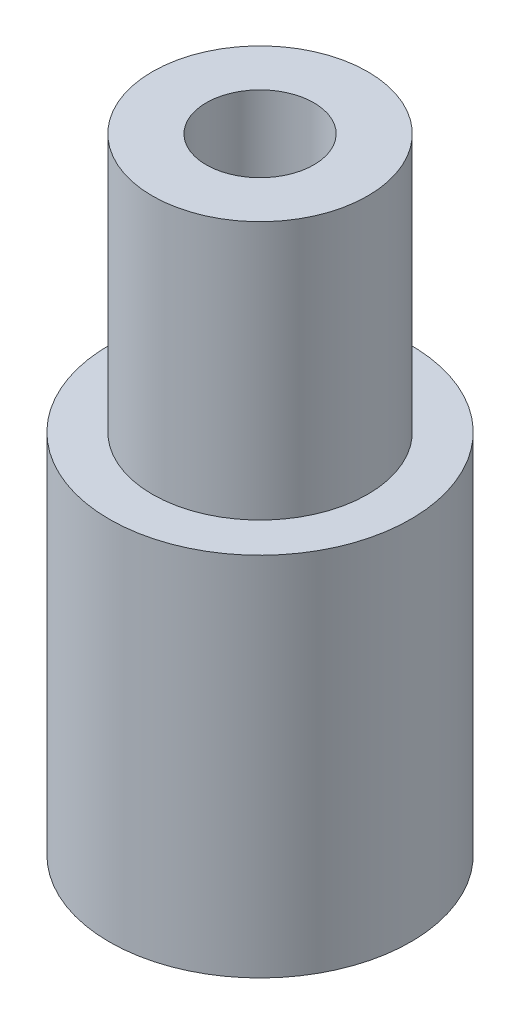
ISO-10303-21;
HEADER;
FILE_DESCRIPTION(('STEP AP214'),'2;1');
FILE_NAME('part.step','',(''),(''),'','','');
FILE_SCHEMA(('AUTOMOTIVE_DESIGN { 1 0 10303 214 1 1 1 1 }'));
ENDSEC;
DATA;
#1=APPLICATION_CONTEXT('core data for automotive mechanical design processes');
#2=APPLICATION_PROTOCOL_DEFINITION('international standard','automotive_design',2000,#1);
#3=PRODUCT_CONTEXT('',#1,'mechanical');
#4=PRODUCT('Part','Part','',(#3));
#5=PRODUCT_RELATED_PRODUCT_CATEGORY('part','',(#4));
#6=PRODUCT_DEFINITION_FORMATION('','',#4);
#7=PRODUCT_DEFINITION_CONTEXT('part definition',#1,'design');
#8=PRODUCT_DEFINITION('design','',#6,#7);
#9=PRODUCT_DEFINITION_SHAPE('','',#8);
#10=(LENGTH_UNIT() NAMED_UNIT(*) SI_UNIT(.MILLI.,.METRE.));
#11=(NAMED_UNIT(*) PLANE_ANGLE_UNIT() SI_UNIT($,.RADIAN.));
#12=(NAMED_UNIT(*) SI_UNIT($,.STERADIAN.) SOLID_ANGLE_UNIT());
#13=UNCERTAINTY_MEASURE_WITH_UNIT(LENGTH_MEASURE(1.E-05),#10,'distance_accuracy_value','');
#14=(GEOMETRIC_REPRESENTATION_CONTEXT(3) GLOBAL_UNCERTAINTY_ASSIGNED_CONTEXT((#13)) GLOBAL_UNIT_ASSIGNED_CONTEXT((#10,
#11,#12)) REPRESENTATION_CONTEXT('',''));
#15=CARTESIAN_POINT('',(0.,0.,0.));
#16=DIRECTION('',(0.,0.,1.));
#17=DIRECTION('',(1.,0.,0.));
#18=AXIS2_PLACEMENT_3D('',#15,#16,#17);
#19=CARTESIAN_POINT('',(0.,17.,0.));
#20=DIRECTION('',(0.,-1.,0.));
#21=DIRECTION('',(0.,0.,-1.));
#22=AXIS2_PLACEMENT_3D('',#19,#20,#21);
#23=CYLINDRICAL_SURFACE('',#22,7.);
#24=CARTESIAN_POINT('',(0.,17.,0.));
#25=DIRECTION('',(0.,1.,0.));
#26=DIRECTION('',(0.,0.,1.));
#27=AXIS2_PLACEMENT_3D('',#24,#25,#26);
#28=CIRCLE('',#27,7.);
#29=CARTESIAN_POINT('',(0.,17.,7.));
#30=VERTEX_POINT('',#29);
#31=EDGE_CURVE('E40',#30,#30,#28,.T.);
#32=ORIENTED_EDGE('',*,*,#31,.F.);
#33=EDGE_LOOP('',(#32));
#34=FACE_BOUND('',#33,.T.);
#35=CARTESIAN_POINT('',(0.,0.,0.));
#36=DIRECTION('',(0.,1.,0.));
#37=DIRECTION('',(0.,0.,1.));
#38=AXIS2_PLACEMENT_3D('',#35,#36,#37);
#39=CIRCLE('',#38,7.);
#40=CARTESIAN_POINT('',(0.,0.,7.));
#41=VERTEX_POINT('',#40);
#42=EDGE_CURVE('E36',#41,#41,#39,.T.);
#43=ORIENTED_EDGE('',*,*,#42,.T.);
#44=EDGE_LOOP('',(#43));
#45=FACE_BOUND('',#44,.T.);
#46=ADVANCED_FACE('F33',(#34,#45),#23,.T.);
#47=CARTESIAN_POINT('',(0.,17.,0.));
#48=DIRECTION('',(0.,1.,0.));
#49=DIRECTION('',(0.,0.,1.));
#50=AXIS2_PLACEMENT_3D('',#47,#48,#49);
#51=PLANE('',#50);
#52=CARTESIAN_POINT('',(0.,17.,0.));
#53=DIRECTION('',(0.,1.,0.));
#54=DIRECTION('',(0.,0.,1.));
#55=AXIS2_PLACEMENT_3D('',#52,#53,#54);
#56=CIRCLE('',#55,5.);
#57=CARTESIAN_POINT('',(0.,17.,5.));
#58=VERTEX_POINT('',#57);
#59=EDGE_CURVE('E10',#58,#58,#56,.T.);
#60=ORIENTED_EDGE('',*,*,#59,.F.);
#61=EDGE_LOOP('',(#60));
#62=FACE_BOUND('',#61,.T.);
#63=ORIENTED_EDGE('',*,*,#31,.T.);
#64=EDGE_LOOP('',(#63));
#65=FACE_BOUND('',#64,.T.);
#66=ADVANCED_FACE('F77',(#62,#65),#51,.T.);
#67=CARTESIAN_POINT('',(0.,0.,0.));
#68=DIRECTION('',(0.,1.,0.));
#69=DIRECTION('',(0.,0.,1.));
#70=AXIS2_PLACEMENT_3D('',#67,#68,#69);
#71=PLANE('',#70);
#72=ORIENTED_EDGE('',*,*,#42,.F.);
#73=EDGE_LOOP('',(#72));
#74=FACE_BOUND('',#73,.T.);
#75=ADVANCED_FACE('F72',(#74),#71,.F.);
#76=CARTESIAN_POINT('',(0.,29.,0.));
#77=DIRECTION('',(0.,-1.,0.));
#78=DIRECTION('',(0.,0.,-1.));
#79=AXIS2_PLACEMENT_3D('',#76,#77,#78);
#80=CYLINDRICAL_SURFACE('',#79,5.);
#81=CARTESIAN_POINT('',(0.,29.,0.));
#82=DIRECTION('',(0.,1.,0.));
#83=DIRECTION('',(0.,0.,1.));
#84=AXIS2_PLACEMENT_3D('',#81,#82,#83);
#85=CIRCLE('',#84,5.);
#86=CARTESIAN_POINT('',(0.,29.,5.));
#87=VERTEX_POINT('',#86);
#88=EDGE_CURVE('E46',#87,#87,#85,.T.);
#89=ORIENTED_EDGE('',*,*,#88,.F.);
#90=EDGE_LOOP('',(#89));
#91=FACE_BOUND('',#90,.T.);
#92=ORIENTED_EDGE('',*,*,#59,.T.);
#93=EDGE_LOOP('',(#92));
#94=FACE_BOUND('',#93,.T.);
#95=ADVANCED_FACE('F67',(#91,#94),#80,.T.);
#96=CARTESIAN_POINT('',(0.,29.,0.));
#97=DIRECTION('',(0.,1.,0.));
#98=DIRECTION('',(0.,0.,1.));
#99=AXIS2_PLACEMENT_3D('',#96,#97,#98);
#100=PLANE('',#99);
#101=CARTESIAN_POINT('',(0.,29.,0.));
#102=DIRECTION('',(0.,1.,0.));
#103=DIRECTION('',(0.,0.,1.));
#104=AXIS2_PLACEMENT_3D('',#101,#102,#103);
#105=CIRCLE('',#104,2.5);
#106=CARTESIAN_POINT('',(0.,29.,2.5));
#107=VERTEX_POINT('',#106);
#108=EDGE_CURVE('E50',#107,#107,#105,.T.);
#109=ORIENTED_EDGE('',*,*,#108,.F.);
#110=EDGE_LOOP('',(#109));
#111=FACE_BOUND('',#110,.T.);
#112=ORIENTED_EDGE('',*,*,#88,.T.);
#113=EDGE_LOOP('',(#112));
#114=FACE_BOUND('',#113,.T.);
#115=ADVANCED_FACE('F61',(#111,#114),#100,.T.);
#116=CARTESIAN_POINT('',(0.,15.,0.));
#117=DIRECTION('',(0.,1.,0.));
#118=DIRECTION('',(0.,0.,1.));
#119=AXIS2_PLACEMENT_3D('',#116,#117,#118);
#120=CYLINDRICAL_SURFACE('',#119,2.5);
#121=CARTESIAN_POINT('',(0.,15.,0.));
#122=DIRECTION('',(0.,1.,0.));
#123=DIRECTION('',(0.,0.,1.));
#124=AXIS2_PLACEMENT_3D('',#121,#122,#123);
#125=CIRCLE('',#124,2.5);
#126=CARTESIAN_POINT('',(0.,15.,2.5));
#127=VERTEX_POINT('',#126);
#128=EDGE_CURVE('E49',#127,#127,#125,.T.);
#129=ORIENTED_EDGE('',*,*,#128,.F.);
#130=EDGE_LOOP('',(#129));
#131=FACE_BOUND('',#130,.T.);
#132=ORIENTED_EDGE('',*,*,#108,.T.);
#133=EDGE_LOOP('',(#132));
#134=FACE_BOUND('',#133,.T.);
#135=ADVANCED_FACE('F58',(#131,#134),#120,.F.);
#136=CARTESIAN_POINT('',(0.,15.,0.));
#137=DIRECTION('',(0.,1.,0.));
#138=DIRECTION('',(0.,0.,1.));
#139=AXIS2_PLACEMENT_3D('',#136,#137,#138);
#140=PLANE('',#139);
#141=ORIENTED_EDGE('',*,*,#128,.T.);
#142=EDGE_LOOP('',(#141));
#143=FACE_BOUND('',#142,.T.);
#144=ADVANCED_FACE('F56',(#143),#140,.T.);
#145=CLOSED_SHELL('',(#46,#66,#75,#95,#115,#135,#144));
#146=MANIFOLD_SOLID_BREP('B2',#145);
#147=ADVANCED_BREP_SHAPE_REPRESENTATION('',(#18,#146),#14);
#148=SHAPE_DEFINITION_REPRESENTATION(#9,#147);
ENDSEC;
END-ISO-10303-21;
